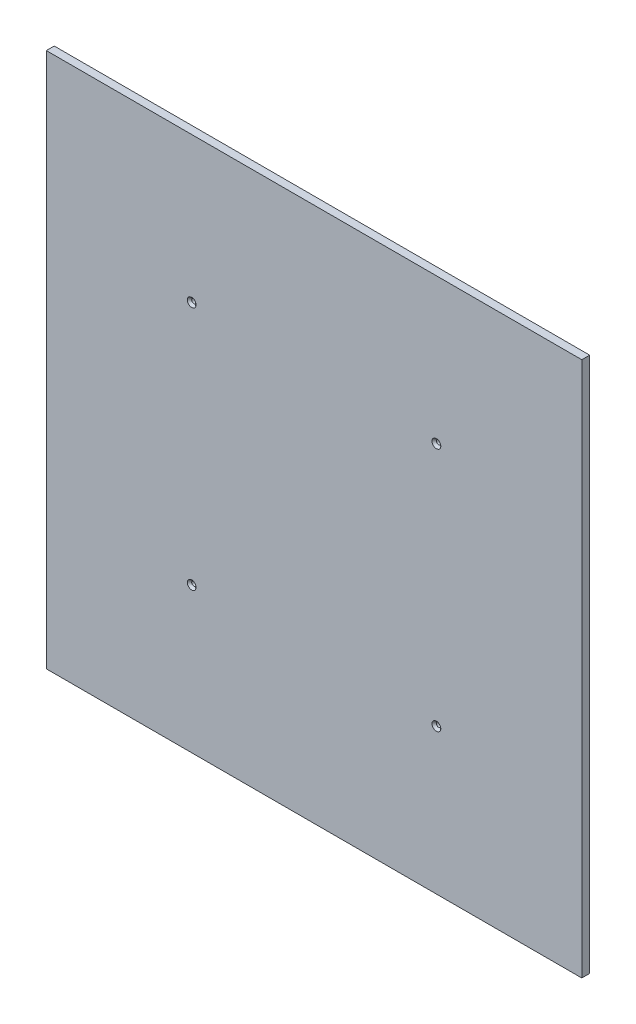
ISO-10303-21;
HEADER;
FILE_DESCRIPTION(('STEP AP214'),'2;1');
FILE_NAME('part.step','',(''),(''),'','','');
FILE_SCHEMA(('AUTOMOTIVE_DESIGN { 1 0 10303 214 1 1 1 1 }'));
ENDSEC;
DATA;
#1=APPLICATION_CONTEXT('core data for automotive mechanical design processes');
#2=APPLICATION_PROTOCOL_DEFINITION('international standard','automotive_design',2000,#1);
#3=PRODUCT_CONTEXT('',#1,'mechanical');
#4=PRODUCT('Part','Part','',(#3));
#5=PRODUCT_RELATED_PRODUCT_CATEGORY('part','',(#4));
#6=PRODUCT_DEFINITION_FORMATION('','',#4);
#7=PRODUCT_DEFINITION_CONTEXT('part definition',#1,'design');
#8=PRODUCT_DEFINITION('design','',#6,#7);
#9=PRODUCT_DEFINITION_SHAPE('','',#8);
#10=(LENGTH_UNIT() NAMED_UNIT(*) SI_UNIT(.MILLI.,.METRE.));
#11=(NAMED_UNIT(*) PLANE_ANGLE_UNIT() SI_UNIT($,.RADIAN.));
#12=(NAMED_UNIT(*) SI_UNIT($,.STERADIAN.) SOLID_ANGLE_UNIT());
#13=UNCERTAINTY_MEASURE_WITH_UNIT(LENGTH_MEASURE(1.E-05),#10,'distance_accuracy_value','');
#14=(GEOMETRIC_REPRESENTATION_CONTEXT(3) GLOBAL_UNCERTAINTY_ASSIGNED_CONTEXT((#13)) GLOBAL_UNIT_ASSIGNED_CONTEXT((#10,
#11,#12)) REPRESENTATION_CONTEXT('',''));
#15=CARTESIAN_POINT('',(0.,0.,0.));
#16=DIRECTION('',(0.,0.,1.));
#17=DIRECTION('',(1.,0.,0.));
#18=AXIS2_PLACEMENT_3D('',#15,#16,#17);
#19=CARTESIAN_POINT('',(-610.,-610.,-10.));
#20=DIRECTION('',(-1.,0.,0.));
#21=DIRECTION('',(0.,0.,1.));
#22=AXIS2_PLACEMENT_3D('',#19,#20,#21);
#23=PLANE('',#22);
#24=DIRECTION('',(0.,-1.,0.));
#25=VECTOR('',#24,1.);
#26=CARTESIAN_POINT('',(-610.,-610.,8.));
#27=LINE('',#26,#25);
#28=CARTESIAN_POINT('',(-610.,610.,8.));
#29=VERTEX_POINT('',#28);
#30=CARTESIAN_POINT('',(-610.,-610.,8.));
#31=VERTEX_POINT('',#30);
#32=EDGE_CURVE('E103',#29,#31,#27,.T.);
#33=ORIENTED_EDGE('',*,*,#32,.F.);
#34=DIRECTION('',(0.,0.,1.));
#35=VECTOR('',#34,1.);
#36=CARTESIAN_POINT('',(-610.,610.,-10.));
#37=LINE('',#36,#35);
#38=CARTESIAN_POINT('',(-610.,610.,-10.));
#39=VERTEX_POINT('',#38);
#40=EDGE_CURVE('E51',#39,#29,#37,.T.);
#41=ORIENTED_EDGE('',*,*,#40,.F.);
#42=DIRECTION('',(0.,-1.,0.));
#43=VECTOR('',#42,1.);
#44=CARTESIAN_POINT('',(-610.,-610.,-10.));
#45=LINE('',#44,#43);
#46=CARTESIAN_POINT('',(-610.,-610.,-10.));
#47=VERTEX_POINT('',#46);
#48=EDGE_CURVE('E96',#39,#47,#45,.T.);
#49=ORIENTED_EDGE('',*,*,#48,.T.);
#50=DIRECTION('',(0.,0.,1.));
#51=VECTOR('',#50,1.);
#52=CARTESIAN_POINT('',(-610.,-610.,-10.));
#53=LINE('',#52,#51);
#54=EDGE_CURVE('E79',#47,#31,#53,.T.);
#55=ORIENTED_EDGE('',*,*,#54,.T.);
#56=EDGE_LOOP('',(#33,#41,#49,#55));
#57=FACE_BOUND('',#56,.T.);
#58=ADVANCED_FACE('F34',(#57),#23,.T.);
#59=CARTESIAN_POINT('',(610.,610.,-10.));
#60=DIRECTION('',(0.,1.,0.));
#61=DIRECTION('',(-1.,0.,0.));
#62=AXIS2_PLACEMENT_3D('',#59,#60,#61);
#63=PLANE('',#62);
#64=DIRECTION('',(-1.,0.,0.));
#65=VECTOR('',#64,1.);
#66=CARTESIAN_POINT('',(610.,610.,8.));
#67=LINE('',#66,#65);
#68=CARTESIAN_POINT('',(610.,610.,8.));
#69=VERTEX_POINT('',#68);
#70=EDGE_CURVE('E98',#69,#29,#67,.T.);
#71=ORIENTED_EDGE('',*,*,#70,.F.);
#72=DIRECTION('',(0.,0.,1.));
#73=VECTOR('',#72,1.);
#74=CARTESIAN_POINT('',(610.,610.,-10.));
#75=LINE('',#74,#73);
#76=CARTESIAN_POINT('',(610.,610.,-10.));
#77=VERTEX_POINT('',#76);
#78=EDGE_CURVE('E68',#77,#69,#75,.T.);
#79=ORIENTED_EDGE('',*,*,#78,.F.);
#80=DIRECTION('',(-1.,0.,0.));
#81=VECTOR('',#80,1.);
#82=CARTESIAN_POINT('',(610.,610.,-10.));
#83=LINE('',#82,#81);
#84=EDGE_CURVE('E93',#77,#39,#83,.T.);
#85=ORIENTED_EDGE('',*,*,#84,.T.);
#86=ORIENTED_EDGE('',*,*,#40,.T.);
#87=EDGE_LOOP('',(#71,#79,#85,#86));
#88=FACE_BOUND('',#87,.T.);
#89=ADVANCED_FACE('F152',(#88),#63,.T.);
#90=CARTESIAN_POINT('',(610.,-610.,-10.));
#91=DIRECTION('',(1.,0.,0.));
#92=DIRECTION('',(0.,0.,-1.));
#93=AXIS2_PLACEMENT_3D('',#90,#91,#92);
#94=PLANE('',#93);
#95=DIRECTION('',(0.,1.,0.));
#96=VECTOR('',#95,1.);
#97=CARTESIAN_POINT('',(610.,-610.,8.));
#98=LINE('',#97,#96);
#99=CARTESIAN_POINT('',(610.,-610.,8.));
#100=VERTEX_POINT('',#99);
#101=EDGE_CURVE('E87',#100,#69,#98,.T.);
#102=ORIENTED_EDGE('',*,*,#101,.F.);
#103=DIRECTION('',(0.,0.,1.));
#104=VECTOR('',#103,1.);
#105=CARTESIAN_POINT('',(610.,-610.,-10.));
#106=LINE('',#105,#104);
#107=CARTESIAN_POINT('',(610.,-610.,-10.));
#108=VERTEX_POINT('',#107);
#109=EDGE_CURVE('E82',#108,#100,#106,.T.);
#110=ORIENTED_EDGE('',*,*,#109,.F.);
#111=DIRECTION('',(0.,1.,0.));
#112=VECTOR('',#111,1.);
#113=CARTESIAN_POINT('',(610.,-610.,-10.));
#114=LINE('',#113,#112);
#115=EDGE_CURVE('E85',#108,#77,#114,.T.);
#116=ORIENTED_EDGE('',*,*,#115,.T.);
#117=ORIENTED_EDGE('',*,*,#78,.T.);
#118=EDGE_LOOP('',(#102,#110,#116,#117));
#119=FACE_BOUND('',#118,.T.);
#120=ADVANCED_FACE('F84',(#119),#94,.T.);
#121=CARTESIAN_POINT('',(610.,-610.,-10.));
#122=DIRECTION('',(0.,-1.,0.));
#123=DIRECTION('',(1.,0.,0.));
#124=AXIS2_PLACEMENT_3D('',#121,#122,#123);
#125=PLANE('',#124);
#126=DIRECTION('',(1.,0.,0.));
#127=VECTOR('',#126,1.);
#128=CARTESIAN_POINT('',(610.,-610.,8.));
#129=LINE('',#128,#127);
#130=EDGE_CURVE('E106',#31,#100,#129,.T.);
#131=ORIENTED_EDGE('',*,*,#130,.F.);
#132=ORIENTED_EDGE('',*,*,#54,.F.);
#133=DIRECTION('',(1.,0.,0.));
#134=VECTOR('',#133,1.);
#135=CARTESIAN_POINT('',(610.,-610.,-10.));
#136=LINE('',#135,#134);
#137=EDGE_CURVE('E92',#47,#108,#136,.T.);
#138=ORIENTED_EDGE('',*,*,#137,.T.);
#139=ORIENTED_EDGE('',*,*,#109,.T.);
#140=EDGE_LOOP('',(#131,#132,#138,#139));
#141=FACE_BOUND('',#140,.T.);
#142=ADVANCED_FACE('F95',(#141),#125,.T.);
#143=CARTESIAN_POINT('',(0.,0.,-10.));
#144=DIRECTION('',(0.,0.,1.));
#145=DIRECTION('',(1.,0.,0.));
#146=AXIS2_PLACEMENT_3D('',#143,#144,#145);
#147=PLANE('',#146);
#148=CARTESIAN_POINT('',(-278.763455967294,278.763455967288,-10.));
#149=DIRECTION('',(0.,0.,-1.));
#150=DIRECTION('',(-1.,0.,0.));
#151=AXIS2_PLACEMENT_3D('',#148,#149,#150);
#152=CIRCLE('',#151,4.99999999999999);
#153=CARTESIAN_POINT('',(-283.763455967294,278.763455967288,-10.));
#154=VERTEX_POINT('',#153);
#155=EDGE_CURVE('E184',#154,#154,#152,.T.);
#156=ORIENTED_EDGE('',*,*,#155,.F.);
#157=EDGE_LOOP('',(#156));
#158=FACE_BOUND('',#157,.T.);
#159=CARTESIAN_POINT('',(-278.763455967287,-278.763455967295,-10.));
#160=DIRECTION('',(0.,0.,-1.));
#161=DIRECTION('',(-1.,0.,0.));
#162=AXIS2_PLACEMENT_3D('',#159,#160,#161);
#163=CIRCLE('',#162,4.99999999999999);
#164=CARTESIAN_POINT('',(-283.763455967287,-278.763455967295,-10.));
#165=VERTEX_POINT('',#164);
#166=EDGE_CURVE('E186',#165,#165,#163,.T.);
#167=ORIENTED_EDGE('',*,*,#166,.F.);
#168=EDGE_LOOP('',(#167));
#169=FACE_BOUND('',#168,.T.);
#170=CARTESIAN_POINT('',(278.763455967292,-278.76345596729,-10.));
#171=DIRECTION('',(0.,0.,-1.));
#172=DIRECTION('',(-1.,0.,0.));
#173=AXIS2_PLACEMENT_3D('',#170,#171,#172);
#174=CIRCLE('',#173,4.99999999999999);
#175=CARTESIAN_POINT('',(273.763455967292,-278.76345596729,-10.));
#176=VERTEX_POINT('',#175);
#177=EDGE_CURVE('E189',#176,#176,#174,.T.);
#178=ORIENTED_EDGE('',*,*,#177,.F.);
#179=EDGE_LOOP('',(#178));
#180=FACE_BOUND('',#179,.T.);
#181=CARTESIAN_POINT('',(278.763455967289,278.763455967293,-10.));
#182=DIRECTION('',(0.,0.,-1.));
#183=DIRECTION('',(-1.,0.,0.));
#184=AXIS2_PLACEMENT_3D('',#181,#182,#183);
#185=CIRCLE('',#184,4.99999999999999);
#186=CARTESIAN_POINT('',(273.763455967289,278.763455967293,-10.));
#187=VERTEX_POINT('',#186);
#188=EDGE_CURVE('E107',#187,#187,#185,.T.);
#189=ORIENTED_EDGE('',*,*,#188,.F.);
#190=EDGE_LOOP('',(#189));
#191=FACE_BOUND('',#190,.T.);
#192=ORIENTED_EDGE('',*,*,#48,.F.);
#193=ORIENTED_EDGE('',*,*,#84,.F.);
#194=ORIENTED_EDGE('',*,*,#115,.F.);
#195=ORIENTED_EDGE('',*,*,#137,.F.);
#196=EDGE_LOOP('',(#192,#193,#194,#195));
#197=FACE_BOUND('',#196,.T.);
#198=ADVANCED_FACE('F91',(#158,#169,#180,#191,#197),#147,.F.);
#199=CARTESIAN_POINT('',(0.,0.,8.));
#200=DIRECTION('',(0.,0.,1.));
#201=DIRECTION('',(1.,0.,0.));
#202=AXIS2_PLACEMENT_3D('',#199,#200,#201);
#203=PLANE('',#202);
#204=CARTESIAN_POINT('',(278.763455967289,278.763455967293,8.));
#205=DIRECTION('',(0.,0.,1.));
#206=DIRECTION('',(1.,0.,0.));
#207=AXIS2_PLACEMENT_3D('',#204,#205,#206);
#208=CIRCLE('',#207,10.);
#209=CARTESIAN_POINT('',(288.763455967289,278.763455967293,8.));
#210=VERTEX_POINT('',#209);
#211=EDGE_CURVE('E124',#210,#210,#208,.F.);
#212=ORIENTED_EDGE('',*,*,#211,.T.);
#213=EDGE_LOOP('',(#212));
#214=FACE_BOUND('',#213,.T.);
#215=CARTESIAN_POINT('',(-278.763455967294,278.763455967288,8.));
#216=DIRECTION('',(0.,0.,1.));
#217=DIRECTION('',(1.,0.,0.));
#218=AXIS2_PLACEMENT_3D('',#215,#216,#217);
#219=CIRCLE('',#218,10.);
#220=CARTESIAN_POINT('',(-268.763455967294,278.763455967288,8.));
#221=VERTEX_POINT('',#220);
#222=EDGE_CURVE('E121',#221,#221,#219,.F.);
#223=ORIENTED_EDGE('',*,*,#222,.T.);
#224=EDGE_LOOP('',(#223));
#225=FACE_BOUND('',#224,.T.);
#226=CARTESIAN_POINT('',(-278.763455967287,-278.763455967295,8.));
#227=DIRECTION('',(0.,0.,1.));
#228=DIRECTION('',(1.,0.,0.));
#229=AXIS2_PLACEMENT_3D('',#226,#227,#228);
#230=CIRCLE('',#229,10.);
#231=CARTESIAN_POINT('',(-268.763455967287,-278.763455967295,8.));
#232=VERTEX_POINT('',#231);
#233=EDGE_CURVE('E118',#232,#232,#230,.F.);
#234=ORIENTED_EDGE('',*,*,#233,.T.);
#235=EDGE_LOOP('',(#234));
#236=FACE_BOUND('',#235,.T.);
#237=CARTESIAN_POINT('',(278.763455967292,-278.76345596729,8.));
#238=DIRECTION('',(0.,0.,1.));
#239=DIRECTION('',(1.,0.,0.));
#240=AXIS2_PLACEMENT_3D('',#237,#238,#239);
#241=CIRCLE('',#240,10.0000000000002);
#242=CARTESIAN_POINT('',(288.763455967292,-278.76345596729,8.));
#243=VERTEX_POINT('',#242);
#244=EDGE_CURVE('E113',#243,#243,#241,.F.);
#245=ORIENTED_EDGE('',*,*,#244,.T.);
#246=EDGE_LOOP('',(#245));
#247=FACE_BOUND('',#246,.T.);
#248=ORIENTED_EDGE('',*,*,#32,.T.);
#249=ORIENTED_EDGE('',*,*,#130,.T.);
#250=ORIENTED_EDGE('',*,*,#101,.T.);
#251=ORIENTED_EDGE('',*,*,#70,.T.);
#252=EDGE_LOOP('',(#248,#249,#250,#251));
#253=FACE_BOUND('',#252,.T.);
#254=ADVANCED_FACE('F144',(#214,#225,#236,#247,#253),#203,.T.);
#255=CARTESIAN_POINT('',(278.763455967289,278.763455967293,8.));
#256=DIRECTION('',(0.,0.,-1.));
#257=DIRECTION('',(-1.,0.,0.));
#258=AXIS2_PLACEMENT_3D('',#255,#256,#257);
#259=CYLINDRICAL_SURFACE('',#258,4.99999999999999);
#260=CARTESIAN_POINT('',(278.763455967289,278.763455967293,2.99999999999997));
#261=DIRECTION('',(0.,0.,1.));
#262=DIRECTION('',(1.,0.,0.));
#263=AXIS2_PLACEMENT_3D('',#260,#261,#262);
#264=CIRCLE('',#263,4.99999999999999);
#265=CARTESIAN_POINT('',(283.763455967289,278.763455967293,2.99999999999997));
#266=VERTEX_POINT('',#265);
#267=EDGE_CURVE('E127',#266,#266,#264,.T.);
#268=ORIENTED_EDGE('',*,*,#267,.T.);
#269=EDGE_LOOP('',(#268));
#270=FACE_BOUND('',#269,.T.);
#271=ORIENTED_EDGE('',*,*,#188,.T.);
#272=EDGE_LOOP('',(#271));
#273=FACE_BOUND('',#272,.T.);
#274=ADVANCED_FACE('F147',(#270,#273),#259,.F.);
#275=CARTESIAN_POINT('',(278.763455967292,-278.76345596729,8.));
#276=DIRECTION('',(0.,0.,-1.));
#277=DIRECTION('',(-1.,0.,0.));
#278=AXIS2_PLACEMENT_3D('',#275,#276,#277);
#279=CYLINDRICAL_SURFACE('',#278,4.99999999999999);
#280=CARTESIAN_POINT('',(278.763455967292,-278.76345596729,2.99999999999974));
#281=DIRECTION('',(0.,0.,1.));
#282=DIRECTION('',(1.,0.,0.));
#283=AXIS2_PLACEMENT_3D('',#280,#281,#282);
#284=CIRCLE('',#283,4.99999999999999);
#285=CARTESIAN_POINT('',(283.763455967292,-278.76345596729,2.99999999999974));
#286=VERTEX_POINT('',#285);
#287=EDGE_CURVE('E11',#286,#286,#284,.T.);
#288=ORIENTED_EDGE('',*,*,#287,.T.);
#289=EDGE_LOOP('',(#288));
#290=FACE_BOUND('',#289,.T.);
#291=ORIENTED_EDGE('',*,*,#177,.T.);
#292=EDGE_LOOP('',(#291));
#293=FACE_BOUND('',#292,.T.);
#294=ADVANCED_FACE('F198',(#290,#293),#279,.F.);
#295=CARTESIAN_POINT('',(-278.763455967287,-278.763455967295,8.));
#296=DIRECTION('',(0.,0.,-1.));
#297=DIRECTION('',(-1.,0.,0.));
#298=AXIS2_PLACEMENT_3D('',#295,#296,#297);
#299=CYLINDRICAL_SURFACE('',#298,4.99999999999999);
#300=CARTESIAN_POINT('',(-278.763455967287,-278.763455967295,2.99999999999997));
#301=DIRECTION('',(0.,0.,1.));
#302=DIRECTION('',(1.,0.,0.));
#303=AXIS2_PLACEMENT_3D('',#300,#301,#302);
#304=CIRCLE('',#303,4.99999999999999);
#305=CARTESIAN_POINT('',(-273.763455967287,-278.763455967295,2.99999999999997));
#306=VERTEX_POINT('',#305);
#307=EDGE_CURVE('E43',#306,#306,#304,.T.);
#308=ORIENTED_EDGE('',*,*,#307,.T.);
#309=EDGE_LOOP('',(#308));
#310=FACE_BOUND('',#309,.T.);
#311=ORIENTED_EDGE('',*,*,#166,.T.);
#312=EDGE_LOOP('',(#311));
#313=FACE_BOUND('',#312,.T.);
#314=ADVANCED_FACE('F135',(#310,#313),#299,.F.);
#315=CARTESIAN_POINT('',(-278.763455967294,278.763455967288,8.));
#316=DIRECTION('',(0.,0.,-1.));
#317=DIRECTION('',(-1.,0.,0.));
#318=AXIS2_PLACEMENT_3D('',#315,#316,#317);
#319=CYLINDRICAL_SURFACE('',#318,4.99999999999999);
#320=CARTESIAN_POINT('',(-278.763455967294,278.763455967288,2.99999999999997));
#321=DIRECTION('',(0.,0.,1.));
#322=DIRECTION('',(1.,0.,0.));
#323=AXIS2_PLACEMENT_3D('',#320,#321,#322);
#324=CIRCLE('',#323,4.99999999999999);
#325=CARTESIAN_POINT('',(-273.763455967294,278.763455967288,2.99999999999997));
#326=VERTEX_POINT('',#325);
#327=EDGE_CURVE('E130',#326,#326,#324,.T.);
#328=ORIENTED_EDGE('',*,*,#327,.T.);
#329=EDGE_LOOP('',(#328));
#330=FACE_BOUND('',#329,.T.);
#331=ORIENTED_EDGE('',*,*,#155,.T.);
#332=EDGE_LOOP('',(#331));
#333=FACE_BOUND('',#332,.T.);
#334=ADVANCED_FACE('F168',(#330,#333),#319,.F.);
#335=CARTESIAN_POINT('',(278.763455967289,278.763455967293,8.));
#336=DIRECTION('',(0.,0.,1.));
#337=DIRECTION('',(1.,0.,0.));
#338=AXIS2_PLACEMENT_3D('',#335,#336,#337);
#339=CONICAL_SURFACE('',#338,10.,0.785398163397447);
#340=ORIENTED_EDGE('',*,*,#267,.F.);
#341=EDGE_LOOP('',(#340));
#342=FACE_BOUND('',#341,.T.);
#343=ORIENTED_EDGE('',*,*,#211,.F.);
#344=EDGE_LOOP('',(#343));
#345=FACE_BOUND('',#344,.T.);
#346=ADVANCED_FACE('F165',(#342,#345),#339,.F.);
#347=CARTESIAN_POINT('',(-278.763455967294,278.763455967288,8.));
#348=DIRECTION('',(0.,0.,1.));
#349=DIRECTION('',(1.,0.,0.));
#350=AXIS2_PLACEMENT_3D('',#347,#348,#349);
#351=CONICAL_SURFACE('',#350,10.,0.785398163397447);
#352=ORIENTED_EDGE('',*,*,#327,.F.);
#353=EDGE_LOOP('',(#352));
#354=FACE_BOUND('',#353,.T.);
#355=ORIENTED_EDGE('',*,*,#222,.F.);
#356=EDGE_LOOP('',(#355));
#357=FACE_BOUND('',#356,.T.);
#358=ADVANCED_FACE('F141',(#354,#357),#351,.F.);
#359=CARTESIAN_POINT('',(-278.763455967287,-278.763455967295,8.));
#360=DIRECTION('',(0.,0.,1.));
#361=DIRECTION('',(1.,0.,0.));
#362=AXIS2_PLACEMENT_3D('',#359,#360,#361);
#363=CONICAL_SURFACE('',#362,10.,0.785398163397447);
#364=ORIENTED_EDGE('',*,*,#307,.F.);
#365=EDGE_LOOP('',(#364));
#366=FACE_BOUND('',#365,.T.);
#367=ORIENTED_EDGE('',*,*,#233,.F.);
#368=EDGE_LOOP('',(#367));
#369=FACE_BOUND('',#368,.T.);
#370=ADVANCED_FACE('F138',(#366,#369),#363,.F.);
#371=CARTESIAN_POINT('',(278.763455967292,-278.76345596729,8.));
#372=DIRECTION('',(0.,0.,1.));
#373=DIRECTION('',(1.,0.,0.));
#374=AXIS2_PLACEMENT_3D('',#371,#372,#373);
#375=CONICAL_SURFACE('',#374,10.0000000000002,0.785398163397447);
#376=ORIENTED_EDGE('',*,*,#287,.F.);
#377=EDGE_LOOP('',(#376));
#378=FACE_BOUND('',#377,.T.);
#379=ORIENTED_EDGE('',*,*,#244,.F.);
#380=EDGE_LOOP('',(#379));
#381=FACE_BOUND('',#380,.T.);
#382=ADVANCED_FACE('F36',(#378,#381),#375,.F.);
#383=CLOSED_SHELL('',(#58,#89,#120,#142,#198,#254,#274,#294,#314,#334,#346,#358,#370,#382));
#384=MANIFOLD_SOLID_BREP('B2',#383);
#385=ADVANCED_BREP_SHAPE_REPRESENTATION('',(#18,#384),#14);
#386=SHAPE_DEFINITION_REPRESENTATION(#9,#385);
ENDSEC;
END-ISO-10303-21;
